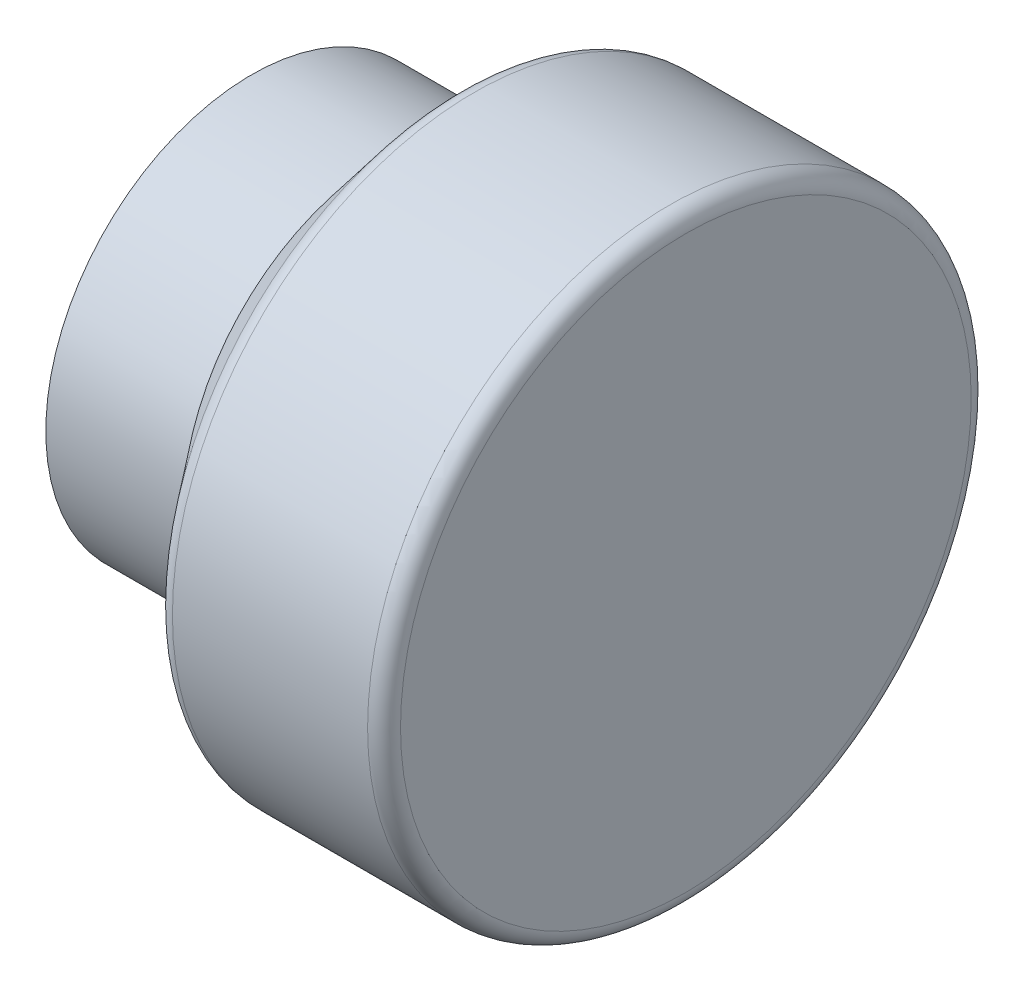
ISO-10303-21;
HEADER;
FILE_DESCRIPTION(('STEP AP214'),'2;1');
FILE_NAME('part.step','',(''),(''),'','','');
FILE_SCHEMA(('AUTOMOTIVE_DESIGN { 1 0 10303 214 1 1 1 1 }'));
ENDSEC;
DATA;
#1=APPLICATION_CONTEXT('core data for automotive mechanical design processes');
#2=APPLICATION_PROTOCOL_DEFINITION('international standard','automotive_design',2000,#1);
#3=PRODUCT_CONTEXT('',#1,'mechanical');
#4=PRODUCT('Part','Part','',(#3));
#5=PRODUCT_RELATED_PRODUCT_CATEGORY('part','',(#4));
#6=PRODUCT_DEFINITION_FORMATION('','',#4);
#7=PRODUCT_DEFINITION_CONTEXT('part definition',#1,'design');
#8=PRODUCT_DEFINITION('design','',#6,#7);
#9=PRODUCT_DEFINITION_SHAPE('','',#8);
#10=(LENGTH_UNIT() NAMED_UNIT(*) SI_UNIT(.MILLI.,.METRE.));
#11=(NAMED_UNIT(*) PLANE_ANGLE_UNIT() SI_UNIT($,.RADIAN.));
#12=(NAMED_UNIT(*) SI_UNIT($,.STERADIAN.) SOLID_ANGLE_UNIT());
#13=UNCERTAINTY_MEASURE_WITH_UNIT(LENGTH_MEASURE(1.E-05),#10,'distance_accuracy_value','');
#14=(GEOMETRIC_REPRESENTATION_CONTEXT(3) GLOBAL_UNCERTAINTY_ASSIGNED_CONTEXT((#13)) GLOBAL_UNIT_ASSIGNED_CONTEXT((#10,
#11,#12)) REPRESENTATION_CONTEXT('',''));
#15=CARTESIAN_POINT('',(0.,0.,0.));
#16=DIRECTION('',(0.,0.,1.));
#17=DIRECTION('',(1.,0.,0.));
#18=AXIS2_PLACEMENT_3D('',#15,#16,#17);
#19=CARTESIAN_POINT('',(3.175,0.,0.));
#20=DIRECTION('',(1.,0.,0.));
#21=DIRECTION('',(0.,0.,-1.));
#22=AXIS2_PLACEMENT_3D('',#19,#20,#21);
#23=CYLINDRICAL_SURFACE('',#22,17.4625);
#24=CARTESIAN_POINT('',(-35.4290048968553,0.,0.));
#25=DIRECTION('',(1.,0.,0.));
#26=DIRECTION('',(0.,0.,-1.));
#27=AXIS2_PLACEMENT_3D('',#24,#25,#26);
#28=CIRCLE('',#27,17.4625);
#29=CARTESIAN_POINT('',(-35.4290048968553,0.,-17.4625));
#30=VERTEX_POINT('',#29);
#31=EDGE_CURVE('E95',#30,#30,#28,.T.);
#32=ORIENTED_EDGE('',*,*,#31,.T.);
#33=EDGE_LOOP('',(#32));
#34=FACE_BOUND('',#33,.T.);
#35=CARTESIAN_POINT('',(-37.0292048968553,0.,0.));
#36=DIRECTION('',(1.,0.,0.));
#37=DIRECTION('',(0.,0.,-1.));
#38=AXIS2_PLACEMENT_3D('',#35,#36,#37);
#39=CIRCLE('',#38,17.4625);
#40=CARTESIAN_POINT('',(-37.0292048968553,0.,-17.4625));
#41=VERTEX_POINT('',#40);
#42=EDGE_CURVE('E67',#41,#41,#39,.T.);
#43=ORIENTED_EDGE('',*,*,#42,.F.);
#44=EDGE_LOOP('',(#43));
#45=FACE_BOUND('',#44,.T.);
#46=ADVANCED_FACE('F43',(#34,#45),#23,.F.);
#47=CARTESIAN_POINT('',(-37.0292048968553,0.,-17.4625));
#48=DIRECTION('',(-1.,0.,0.));
#49=DIRECTION('',(0.,0.,1.));
#50=AXIS2_PLACEMENT_3D('',#47,#48,#49);
#51=PLANE('',#50);
#52=ORIENTED_EDGE('',*,*,#42,.T.);
#53=EDGE_LOOP('',(#52));
#54=FACE_BOUND('',#53,.T.);
#55=CARTESIAN_POINT('',(-37.0292048968553,0.,0.));
#56=DIRECTION('',(1.,0.,0.));
#57=DIRECTION('',(0.,0.,-1.));
#58=AXIS2_PLACEMENT_3D('',#55,#56,#57);
#59=CIRCLE('',#58,19.05);
#60=CARTESIAN_POINT('',(-37.0292048968553,0.,-19.05));
#61=VERTEX_POINT('',#60);
#62=EDGE_CURVE('E71',#61,#61,#59,.T.);
#63=ORIENTED_EDGE('',*,*,#62,.F.);
#64=EDGE_LOOP('',(#63));
#65=FACE_BOUND('',#64,.T.);
#66=ADVANCED_FACE('F117',(#54,#65),#51,.T.);
#67=CARTESIAN_POINT('',(3.175,0.,0.));
#68=DIRECTION('',(1.,0.,0.));
#69=DIRECTION('',(0.,0.,-1.));
#70=AXIS2_PLACEMENT_3D('',#67,#68,#69);
#71=CYLINDRICAL_SURFACE('',#70,19.05);
#72=ORIENTED_EDGE('',*,*,#62,.T.);
#73=EDGE_LOOP('',(#72));
#74=FACE_BOUND('',#73,.T.);
#75=CARTESIAN_POINT('',(-24.3292048968553,0.,0.));
#76=DIRECTION('',(1.,0.,0.));
#77=DIRECTION('',(0.,0.,-1.));
#78=AXIS2_PLACEMENT_3D('',#75,#76,#77);
#79=CIRCLE('',#78,19.05);
#80=CARTESIAN_POINT('',(-24.3292048968553,0.,-19.05));
#81=VERTEX_POINT('',#80);
#82=EDGE_CURVE('E75',#81,#81,#79,.T.);
#83=ORIENTED_EDGE('',*,*,#82,.F.);
#84=EDGE_LOOP('',(#83));
#85=FACE_BOUND('',#84,.T.);
#86=ADVANCED_FACE('F122',(#74,#85),#71,.T.);
#87=CARTESIAN_POINT('',(-17.145,0.,0.));
#88=DIRECTION('',(1.,0.,0.));
#89=DIRECTION('',(0.,0.,-1.));
#90=AXIS2_PLACEMENT_3D('',#87,#88,#89);
#91=CONICAL_SURFACE('',#90,27.94,0.891122507886653);
#92=CARTESIAN_POINT('',(-17.6024827442228,0.,0.));
#93=DIRECTION('',(-1.,0.,0.));
#94=DIRECTION('',(0.,0.,1.));
#95=AXIS2_PLACEMENT_3D('',#92,#93,#94);
#96=CIRCLE('',#95,27.3738939862474);
#97=CARTESIAN_POINT('',(-17.6024827442228,0.,27.3738939862474));
#98=VERTEX_POINT('',#97);
#99=EDGE_CURVE('E10',#98,#98,#96,.T.);
#100=ORIENTED_EDGE('',*,*,#99,.T.);
#101=EDGE_LOOP('',(#100));
#102=FACE_BOUND('',#101,.T.);
#103=ORIENTED_EDGE('',*,*,#82,.T.);
#104=EDGE_LOOP('',(#103));
#105=FACE_BOUND('',#104,.T.);
#106=ADVANCED_FACE('F128',(#102,#105),#91,.T.);
#107=CARTESIAN_POINT('',(3.175,0.,0.));
#108=DIRECTION('',(1.,0.,0.));
#109=DIRECTION('',(0.,0.,-1.));
#110=AXIS2_PLACEMENT_3D('',#107,#108,#109);
#111=CYLINDRICAL_SURFACE('',#110,27.94);
#112=CARTESIAN_POINT('',(1.651,0.,0.));
#113=DIRECTION('',(1.,0.,0.));
#114=DIRECTION('',(0.,0.,-1.));
#115=AXIS2_PLACEMENT_3D('',#112,#113,#114);
#116=CIRCLE('',#115,27.94);
#117=CARTESIAN_POINT('',(1.651,0.,-27.94));
#118=VERTEX_POINT('',#117);
#119=EDGE_CURVE('E51',#118,#118,#116,.F.);
#120=ORIENTED_EDGE('',*,*,#119,.T.);
#121=EDGE_LOOP('',(#120));
#122=FACE_BOUND('',#121,.T.);
#123=CARTESIAN_POINT('',(-16.4171494108895,0.,0.));
#124=DIRECTION('',(-1.,0.,0.));
#125=DIRECTION('',(0.,0.,1.));
#126=AXIS2_PLACEMENT_3D('',#123,#124,#125);
#127=CIRCLE('',#126,27.94);
#128=CARTESIAN_POINT('',(-16.4171494108895,0.,27.94));
#129=VERTEX_POINT('',#128);
#130=EDGE_CURVE('E56',#129,#129,#127,.F.);
#131=ORIENTED_EDGE('',*,*,#130,.T.);
#132=EDGE_LOOP('',(#131));
#133=FACE_BOUND('',#132,.T.);
#134=ADVANCED_FACE('F132',(#122,#133),#111,.T.);
#135=CARTESIAN_POINT('',(3.175,0.,-27.94));
#136=DIRECTION('',(1.,0.,0.));
#137=DIRECTION('',(0.,0.,-1.));
#138=AXIS2_PLACEMENT_3D('',#135,#136,#137);
#139=PLANE('',#138);
#140=CARTESIAN_POINT('',(3.175,0.,0.));
#141=DIRECTION('',(1.,0.,0.));
#142=DIRECTION('',(0.,0.,-1.));
#143=AXIS2_PLACEMENT_3D('',#140,#141,#142);
#144=CIRCLE('',#143,26.416);
#145=CARTESIAN_POINT('',(3.175,0.,-26.416));
#146=VERTEX_POINT('',#145);
#147=EDGE_CURVE('E61',#146,#146,#144,.T.);
#148=ORIENTED_EDGE('',*,*,#147,.T.);
#149=EDGE_LOOP('',(#148));
#150=FACE_BOUND('',#149,.T.);
#151=ADVANCED_FACE('F135',(#150),#139,.T.);
#152=CARTESIAN_POINT('',(0.,0.,0.));
#153=DIRECTION('',(-1.,0.,0.));
#154=DIRECTION('',(0.,0.,1.));
#155=AXIS2_PLACEMENT_3D('',#152,#153,#154);
#156=PLANE('',#155);
#157=CARTESIAN_POINT('',(0.,0.,0.));
#158=DIRECTION('',(1.,0.,0.));
#159=DIRECTION('',(0.,0.,-1.));
#160=AXIS2_PLACEMENT_3D('',#157,#158,#159);
#161=CIRCLE('',#160,24.765);
#162=CARTESIAN_POINT('',(0.,0.,-24.765));
#163=VERTEX_POINT('',#162);
#164=EDGE_CURVE('E79',#163,#163,#161,.T.);
#165=ORIENTED_EDGE('',*,*,#164,.F.);
#166=EDGE_LOOP('',(#165));
#167=FACE_BOUND('',#166,.T.);
#168=ADVANCED_FACE('F138',(#167),#156,.T.);
#169=CARTESIAN_POINT('',(3.175,0.,0.));
#170=DIRECTION('',(1.,0.,0.));
#171=DIRECTION('',(0.,0.,-1.));
#172=AXIS2_PLACEMENT_3D('',#169,#170,#171);
#173=CYLINDRICAL_SURFACE('',#172,24.765);
#174=ORIENTED_EDGE('',*,*,#164,.T.);
#175=EDGE_LOOP('',(#174));
#176=FACE_BOUND('',#175,.T.);
#177=CARTESIAN_POINT('',(-15.6286446060198,0.,0.));
#178=DIRECTION('',(1.,0.,0.));
#179=DIRECTION('',(0.,0.,-1.));
#180=AXIS2_PLACEMENT_3D('',#177,#178,#179);
#181=CIRCLE('',#180,24.765);
#182=CARTESIAN_POINT('',(-15.6286446060198,0.,-24.765));
#183=VERTEX_POINT('',#182);
#184=EDGE_CURVE('E83',#183,#183,#181,.T.);
#185=ORIENTED_EDGE('',*,*,#184,.F.);
#186=EDGE_LOOP('',(#185));
#187=FACE_BOUND('',#186,.T.);
#188=ADVANCED_FACE('F142',(#176,#187),#173,.F.);
#189=CARTESIAN_POINT('',(-22.8128495028751,0.,0.));
#190=DIRECTION('',(1.,0.,0.));
#191=DIRECTION('',(0.,0.,-1.));
#192=AXIS2_PLACEMENT_3D('',#189,#190,#191);
#193=CONICAL_SURFACE('',#192,15.875,0.891122507886653);
#194=ORIENTED_EDGE('',*,*,#184,.T.);
#195=EDGE_LOOP('',(#194));
#196=FACE_BOUND('',#195,.T.);
#197=CARTESIAN_POINT('',(-22.8128495028751,0.,0.));
#198=DIRECTION('',(1.,0.,0.));
#199=DIRECTION('',(0.,0.,-1.));
#200=AXIS2_PLACEMENT_3D('',#197,#198,#199);
#201=CIRCLE('',#200,15.875);
#202=CARTESIAN_POINT('',(-22.8128495028751,0.,-15.875));
#203=VERTEX_POINT('',#202);
#204=EDGE_CURVE('E87',#203,#203,#201,.T.);
#205=ORIENTED_EDGE('',*,*,#204,.F.);
#206=EDGE_LOOP('',(#205));
#207=FACE_BOUND('',#206,.T.);
#208=ADVANCED_FACE('F113',(#196,#207),#193,.F.);
#209=CARTESIAN_POINT('',(3.175,0.,0.));
#210=DIRECTION('',(1.,0.,0.));
#211=DIRECTION('',(0.,0.,-1.));
#212=AXIS2_PLACEMENT_3D('',#209,#210,#211);
#213=CYLINDRICAL_SURFACE('',#212,15.875);
#214=ORIENTED_EDGE('',*,*,#204,.T.);
#215=EDGE_LOOP('',(#214));
#216=FACE_BOUND('',#215,.T.);
#217=CARTESIAN_POINT('',(-35.4290048968553,0.,0.));
#218=DIRECTION('',(1.,0.,0.));
#219=DIRECTION('',(0.,0.,-1.));
#220=AXIS2_PLACEMENT_3D('',#217,#218,#219);
#221=CIRCLE('',#220,15.875);
#222=CARTESIAN_POINT('',(-35.4290048968553,0.,-15.875));
#223=VERTEX_POINT('',#222);
#224=EDGE_CURVE('E91',#223,#223,#221,.T.);
#225=ORIENTED_EDGE('',*,*,#224,.F.);
#226=EDGE_LOOP('',(#225));
#227=FACE_BOUND('',#226,.T.);
#228=ADVANCED_FACE('F105',(#216,#227),#213,.F.);
#229=CARTESIAN_POINT('',(-35.4290048968553,0.,-15.875));
#230=DIRECTION('',(-1.,0.,0.));
#231=DIRECTION('',(0.,0.,1.));
#232=AXIS2_PLACEMENT_3D('',#229,#230,#231);
#233=PLANE('',#232);
#234=ORIENTED_EDGE('',*,*,#224,.T.);
#235=EDGE_LOOP('',(#234));
#236=FACE_BOUND('',#235,.T.);
#237=ORIENTED_EDGE('',*,*,#31,.F.);
#238=EDGE_LOOP('',(#237));
#239=FACE_BOUND('',#238,.T.);
#240=ADVANCED_FACE('F102',(#236,#239),#233,.T.);
#241=CARTESIAN_POINT('',(1.651,0.,0.));
#242=DIRECTION('',(1.,0.,0.));
#243=DIRECTION('',(0.,0.,-1.));
#244=AXIS2_PLACEMENT_3D('',#241,#242,#243);
#245=TOROIDAL_SURFACE('',#244,26.416,1.524);
#246=ORIENTED_EDGE('',*,*,#119,.F.);
#247=EDGE_LOOP('',(#246));
#248=FACE_BOUND('',#247,.T.);
#249=ORIENTED_EDGE('',*,*,#147,.F.);
#250=EDGE_LOOP('',(#249));
#251=FACE_BOUND('',#250,.T.);
#252=ADVANCED_FACE('F104',(#248,#251),#245,.T.);
#253=CARTESIAN_POINT('',(-16.4171494108895,0.,0.));
#254=DIRECTION('',(-1.,0.,0.));
#255=DIRECTION('',(0.,0.,1.));
#256=AXIS2_PLACEMENT_3D('',#253,#254,#255);
#257=TOROIDAL_SURFACE('',#256,26.416,1.524);
#258=ORIENTED_EDGE('',*,*,#99,.F.);
#259=EDGE_LOOP('',(#258));
#260=FACE_BOUND('',#259,.T.);
#261=ORIENTED_EDGE('',*,*,#130,.F.);
#262=EDGE_LOOP('',(#261));
#263=FACE_BOUND('',#262,.T.);
#264=ADVANCED_FACE('F45',(#260,#263),#257,.T.);
#265=CLOSED_SHELL('',(#46,#66,#86,#106,#134,#151,#168,#188,#208,#228,#240,#252,#264));
#266=MANIFOLD_SOLID_BREP('B2',#265);
#267=ADVANCED_BREP_SHAPE_REPRESENTATION('',(#18,#266),#14);
#268=SHAPE_DEFINITION_REPRESENTATION(#9,#267);
ENDSEC;
END-ISO-10303-21;
